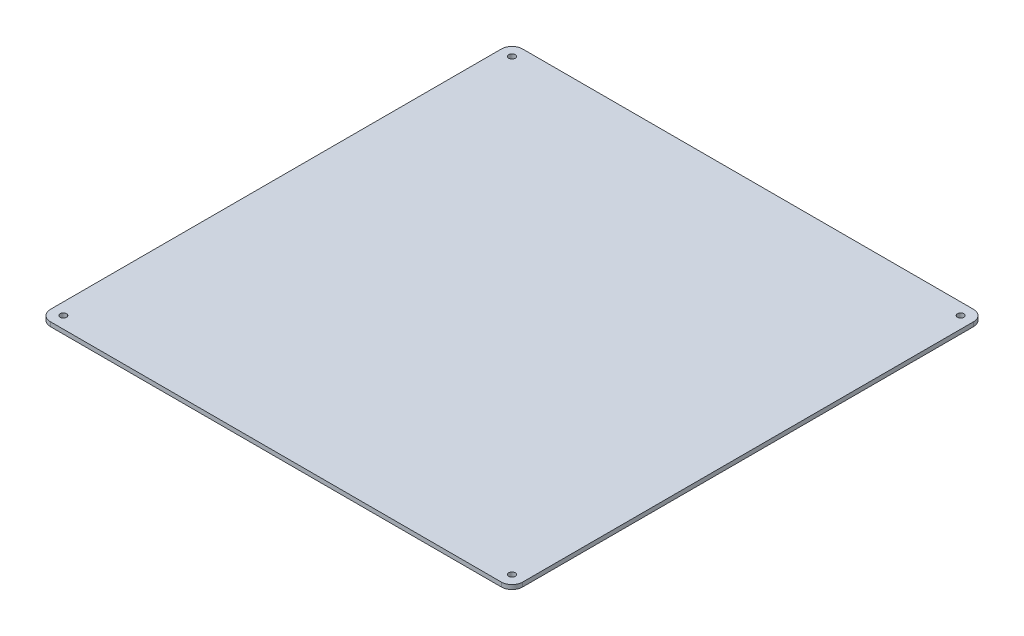
ISO-10303-21;
HEADER;
FILE_DESCRIPTION(('STEP AP214'),'2;1');
FILE_NAME('part.step','',(''),(''),'','','');
FILE_SCHEMA(('AUTOMOTIVE_DESIGN { 1 0 10303 214 1 1 1 1 }'));
ENDSEC;
DATA;
#1=APPLICATION_CONTEXT('core data for automotive mechanical design processes');
#2=APPLICATION_PROTOCOL_DEFINITION('international standard','automotive_design',2000,#1);
#3=PRODUCT_CONTEXT('',#1,'mechanical');
#4=PRODUCT('Part','Part','',(#3));
#5=PRODUCT_RELATED_PRODUCT_CATEGORY('part','',(#4));
#6=PRODUCT_DEFINITION_FORMATION('','',#4);
#7=PRODUCT_DEFINITION_CONTEXT('part definition',#1,'design');
#8=PRODUCT_DEFINITION('design','',#6,#7);
#9=PRODUCT_DEFINITION_SHAPE('','',#8);
#10=(LENGTH_UNIT() NAMED_UNIT(*) SI_UNIT(.MILLI.,.METRE.));
#11=(NAMED_UNIT(*) PLANE_ANGLE_UNIT() SI_UNIT($,.RADIAN.));
#12=(NAMED_UNIT(*) SI_UNIT($,.STERADIAN.) SOLID_ANGLE_UNIT());
#13=UNCERTAINTY_MEASURE_WITH_UNIT(LENGTH_MEASURE(1.E-05),#10,'distance_accuracy_value','');
#14=(GEOMETRIC_REPRESENTATION_CONTEXT(3) GLOBAL_UNCERTAINTY_ASSIGNED_CONTEXT((#13)) GLOBAL_UNIT_ASSIGNED_CONTEXT((#10,
#11,#12)) REPRESENTATION_CONTEXT('',''));
#15=CARTESIAN_POINT('',(0.,0.,0.));
#16=DIRECTION('',(0.,0.,1.));
#17=DIRECTION('',(1.,0.,0.));
#18=AXIS2_PLACEMENT_3D('',#15,#16,#17);
#19=CARTESIAN_POINT('',(0.,-2.,0.));
#20=DIRECTION('',(-1.,0.,0.));
#21=DIRECTION('',(0.,0.,1.));
#22=AXIS2_PLACEMENT_3D('',#19,#20,#21);
#23=PLANE('',#22);
#24=DIRECTION('',(0.,0.,1.));
#25=VECTOR('',#24,1.);
#26=CARTESIAN_POINT('',(0.,0.,0.));
#27=LINE('',#26,#25);
#28=CARTESIAN_POINT('',(0.,0.,-215.));
#29=VERTEX_POINT('',#28);
#30=CARTESIAN_POINT('',(0.,0.,-5.));
#31=VERTEX_POINT('',#30);
#32=EDGE_CURVE('E143',#29,#31,#27,.T.);
#33=ORIENTED_EDGE('',*,*,#32,.F.);
#34=DIRECTION('',(0.,1.,0.));
#35=VECTOR('',#34,1.);
#36=CARTESIAN_POINT('',(0.,-2.,-215.));
#37=LINE('',#36,#35);
#38=CARTESIAN_POINT('',(0.,-2.,-215.));
#39=VERTEX_POINT('',#38);
#40=EDGE_CURVE('E123',#29,#39,#37,.F.);
#41=ORIENTED_EDGE('',*,*,#40,.T.);
#42=DIRECTION('',(0.,0.,1.));
#43=VECTOR('',#42,1.);
#44=CARTESIAN_POINT('',(0.,-2.,0.));
#45=LINE('',#44,#43);
#46=CARTESIAN_POINT('',(0.,-2.,-5.));
#47=VERTEX_POINT('',#46);
#48=EDGE_CURVE('E104',#39,#47,#45,.T.);
#49=ORIENTED_EDGE('',*,*,#48,.T.);
#50=DIRECTION('',(0.,1.,0.));
#51=VECTOR('',#50,1.);
#52=CARTESIAN_POINT('',(0.,-2.,-5.));
#53=LINE('',#52,#51);
#54=EDGE_CURVE('E120',#47,#31,#53,.T.);
#55=ORIENTED_EDGE('',*,*,#54,.T.);
#56=EDGE_LOOP('',(#33,#41,#49,#55));
#57=FACE_BOUND('',#56,.T.);
#58=ADVANCED_FACE('F17',(#57),#23,.T.);
#59=CARTESIAN_POINT('',(0.,-2.,-220.));
#60=DIRECTION('',(0.,0.,-1.));
#61=DIRECTION('',(-1.,0.,0.));
#62=AXIS2_PLACEMENT_3D('',#59,#60,#61);
#63=PLANE('',#62);
#64=DIRECTION('',(-1.,0.,0.));
#65=VECTOR('',#64,1.);
#66=CARTESIAN_POINT('',(0.,-2.,-220.));
#67=LINE('',#66,#65);
#68=CARTESIAN_POINT('',(215.,-2.,-220.));
#69=VERTEX_POINT('',#68);
#70=CARTESIAN_POINT('',(5.,-2.,-220.));
#71=VERTEX_POINT('',#70);
#72=EDGE_CURVE('E109',#69,#71,#67,.T.);
#73=ORIENTED_EDGE('',*,*,#72,.T.);
#74=DIRECTION('',(0.,1.,0.));
#75=VECTOR('',#74,1.);
#76=CARTESIAN_POINT('',(5.,-2.,-220.));
#77=LINE('',#76,#75);
#78=CARTESIAN_POINT('',(5.,0.,-220.));
#79=VERTEX_POINT('',#78);
#80=EDGE_CURVE('E103',#71,#79,#77,.T.);
#81=ORIENTED_EDGE('',*,*,#80,.T.);
#82=DIRECTION('',(-1.,0.,0.));
#83=VECTOR('',#82,1.);
#84=CARTESIAN_POINT('',(0.,0.,-220.));
#85=LINE('',#84,#83);
#86=CARTESIAN_POINT('',(215.,0.,-220.));
#87=VERTEX_POINT('',#86);
#88=EDGE_CURVE('E86',#87,#79,#85,.T.);
#89=ORIENTED_EDGE('',*,*,#88,.F.);
#90=DIRECTION('',(0.,1.,0.));
#91=VECTOR('',#90,1.);
#92=CARTESIAN_POINT('',(215.,-2.,-220.));
#93=LINE('',#92,#91);
#94=EDGE_CURVE('E100',#87,#69,#93,.F.);
#95=ORIENTED_EDGE('',*,*,#94,.T.);
#96=EDGE_LOOP('',(#73,#81,#89,#95));
#97=FACE_BOUND('',#96,.T.);
#98=ADVANCED_FACE('F99',(#97),#63,.T.);
#99=CARTESIAN_POINT('',(220.,-2.,0.));
#100=DIRECTION('',(1.,0.,0.));
#101=DIRECTION('',(0.,0.,-1.));
#102=AXIS2_PLACEMENT_3D('',#99,#100,#101);
#103=PLANE('',#102);
#104=DIRECTION('',(0.,0.,-1.));
#105=VECTOR('',#104,1.);
#106=CARTESIAN_POINT('',(220.,-2.,0.));
#107=LINE('',#106,#105);
#108=CARTESIAN_POINT('',(220.,-2.,-5.));
#109=VERTEX_POINT('',#108);
#110=CARTESIAN_POINT('',(220.,-2.,-215.));
#111=VERTEX_POINT('',#110);
#112=EDGE_CURVE('E113',#109,#111,#107,.T.);
#113=ORIENTED_EDGE('',*,*,#112,.T.);
#114=DIRECTION('',(0.,1.,0.));
#115=VECTOR('',#114,1.);
#116=CARTESIAN_POINT('',(220.,-2.,-215.));
#117=LINE('',#116,#115);
#118=CARTESIAN_POINT('',(220.,0.,-215.));
#119=VERTEX_POINT('',#118);
#120=EDGE_CURVE('E133',#111,#119,#117,.T.);
#121=ORIENTED_EDGE('',*,*,#120,.T.);
#122=DIRECTION('',(0.,0.,-1.));
#123=VECTOR('',#122,1.);
#124=CARTESIAN_POINT('',(220.,0.,0.));
#125=LINE('',#124,#123);
#126=CARTESIAN_POINT('',(220.,0.,-5.));
#127=VERTEX_POINT('',#126);
#128=EDGE_CURVE('E88',#127,#119,#125,.T.);
#129=ORIENTED_EDGE('',*,*,#128,.F.);
#130=DIRECTION('',(0.,1.,0.));
#131=VECTOR('',#130,1.);
#132=CARTESIAN_POINT('',(220.,-2.,-5.));
#133=LINE('',#132,#131);
#134=EDGE_CURVE('E131',#127,#109,#133,.F.);
#135=ORIENTED_EDGE('',*,*,#134,.T.);
#136=EDGE_LOOP('',(#113,#121,#129,#135));
#137=FACE_BOUND('',#136,.T.);
#138=ADVANCED_FACE('F136',(#137),#103,.T.);
#139=CARTESIAN_POINT('',(0.,-2.,0.));
#140=DIRECTION('',(0.,0.,1.));
#141=DIRECTION('',(1.,0.,0.));
#142=AXIS2_PLACEMENT_3D('',#139,#140,#141);
#143=PLANE('',#142);
#144=DIRECTION('',(1.,0.,0.));
#145=VECTOR('',#144,1.);
#146=CARTESIAN_POINT('',(0.,-2.,0.));
#147=LINE('',#146,#145);
#148=CARTESIAN_POINT('',(5.,-2.,0.));
#149=VERTEX_POINT('',#148);
#150=CARTESIAN_POINT('',(215.,-2.,0.));
#151=VERTEX_POINT('',#150);
#152=EDGE_CURVE('E138',#149,#151,#147,.T.);
#153=ORIENTED_EDGE('',*,*,#152,.T.);
#154=DIRECTION('',(0.,1.,0.));
#155=VECTOR('',#154,1.);
#156=CARTESIAN_POINT('',(215.,-2.,0.));
#157=LINE('',#156,#155);
#158=CARTESIAN_POINT('',(215.,0.,0.));
#159=VERTEX_POINT('',#158);
#160=EDGE_CURVE('E11',#151,#159,#157,.T.);
#161=ORIENTED_EDGE('',*,*,#160,.T.);
#162=DIRECTION('',(1.,0.,0.));
#163=VECTOR('',#162,1.);
#164=CARTESIAN_POINT('',(0.,0.,0.));
#165=LINE('',#164,#163);
#166=CARTESIAN_POINT('',(5.,0.,0.));
#167=VERTEX_POINT('',#166);
#168=EDGE_CURVE('E146',#167,#159,#165,.T.);
#169=ORIENTED_EDGE('',*,*,#168,.F.);
#170=DIRECTION('',(0.,1.,0.));
#171=VECTOR('',#170,1.);
#172=CARTESIAN_POINT('',(5.,-2.,0.));
#173=LINE('',#172,#171);
#174=EDGE_CURVE('E25',#167,#149,#173,.F.);
#175=ORIENTED_EDGE('',*,*,#174,.T.);
#176=EDGE_LOOP('',(#153,#161,#169,#175));
#177=FACE_BOUND('',#176,.T.);
#178=ADVANCED_FACE('F149',(#177),#143,.T.);
#179=CARTESIAN_POINT('',(0.,-2.,0.));
#180=DIRECTION('',(0.,-1.,0.));
#181=DIRECTION('',(0.,0.,-1.));
#182=AXIS2_PLACEMENT_3D('',#179,#180,#181);
#183=PLANE('',#182);
#184=CARTESIAN_POINT('',(5.50000000000016,-2.,-214.5));
#185=DIRECTION('',(0.,-1.,0.));
#186=DIRECTION('',(0.,0.,-1.));
#187=AXIS2_PLACEMENT_3D('',#184,#185,#186);
#188=CIRCLE('',#187,1.5);
#189=CARTESIAN_POINT('',(5.50000000000016,-2.,-216.));
#190=VERTEX_POINT('',#189);
#191=EDGE_CURVE('E179',#190,#190,#188,.T.);
#192=ORIENTED_EDGE('',*,*,#191,.F.);
#193=EDGE_LOOP('',(#192));
#194=FACE_BOUND('',#193,.T.);
#195=CARTESIAN_POINT('',(5.50000000000016,-2.,-5.5));
#196=DIRECTION('',(0.,-1.,0.));
#197=DIRECTION('',(0.,0.,-1.));
#198=AXIS2_PLACEMENT_3D('',#195,#196,#197);
#199=CIRCLE('',#198,1.49999999999999);
#200=CARTESIAN_POINT('',(5.50000000000016,-2.,-6.99999999999999));
#201=VERTEX_POINT('',#200);
#202=EDGE_CURVE('E173',#201,#201,#199,.T.);
#203=ORIENTED_EDGE('',*,*,#202,.F.);
#204=EDGE_LOOP('',(#203));
#205=FACE_BOUND('',#204,.T.);
#206=CARTESIAN_POINT('',(214.5,-2.,-214.5));
#207=DIRECTION('',(0.,-1.,0.));
#208=DIRECTION('',(0.,0.,-1.));
#209=AXIS2_PLACEMENT_3D('',#206,#207,#208);
#210=CIRCLE('',#209,1.5);
#211=CARTESIAN_POINT('',(214.5,-2.,-216.));
#212=VERTEX_POINT('',#211);
#213=EDGE_CURVE('E167',#212,#212,#210,.T.);
#214=ORIENTED_EDGE('',*,*,#213,.F.);
#215=EDGE_LOOP('',(#214));
#216=FACE_BOUND('',#215,.T.);
#217=CARTESIAN_POINT('',(214.5,-2.,-5.5));
#218=DIRECTION('',(0.,-1.,0.));
#219=DIRECTION('',(0.,0.,-1.));
#220=AXIS2_PLACEMENT_3D('',#217,#218,#219);
#221=CIRCLE('',#220,1.5);
#222=CARTESIAN_POINT('',(214.5,-2.,-7.));
#223=VERTEX_POINT('',#222);
#224=EDGE_CURVE('E147',#223,#223,#221,.T.);
#225=ORIENTED_EDGE('',*,*,#224,.F.);
#226=EDGE_LOOP('',(#225));
#227=FACE_BOUND('',#226,.T.);
#228=ORIENTED_EDGE('',*,*,#48,.F.);
#229=CARTESIAN_POINT('',(5.,-2.,-215.));
#230=DIRECTION('',(0.,-1.,0.));
#231=DIRECTION('',(0.,0.,-1.));
#232=AXIS2_PLACEMENT_3D('',#229,#230,#231);
#233=CIRCLE('',#232,5.);
#234=EDGE_CURVE('E129',#39,#71,#233,.T.);
#235=ORIENTED_EDGE('',*,*,#234,.T.);
#236=ORIENTED_EDGE('',*,*,#72,.F.);
#237=CARTESIAN_POINT('',(215.,-2.,-215.));
#238=DIRECTION('',(0.,-1.,0.));
#239=DIRECTION('',(0.,0.,-1.));
#240=AXIS2_PLACEMENT_3D('',#237,#238,#239);
#241=CIRCLE('',#240,5.);
#242=EDGE_CURVE('E108',#69,#111,#241,.T.);
#243=ORIENTED_EDGE('',*,*,#242,.T.);
#244=ORIENTED_EDGE('',*,*,#112,.F.);
#245=CARTESIAN_POINT('',(215.,-2.,-5.));
#246=DIRECTION('',(0.,-1.,0.));
#247=DIRECTION('',(0.,0.,-1.));
#248=AXIS2_PLACEMENT_3D('',#245,#246,#247);
#249=CIRCLE('',#248,5.);
#250=EDGE_CURVE('E32',#109,#151,#249,.T.);
#251=ORIENTED_EDGE('',*,*,#250,.T.);
#252=ORIENTED_EDGE('',*,*,#152,.F.);
#253=CARTESIAN_POINT('',(5.,-2.,-5.));
#254=DIRECTION('',(0.,-1.,0.));
#255=DIRECTION('',(0.,0.,-1.));
#256=AXIS2_PLACEMENT_3D('',#253,#254,#255);
#257=CIRCLE('',#256,5.);
#258=EDGE_CURVE('E125',#149,#47,#257,.T.);
#259=ORIENTED_EDGE('',*,*,#258,.T.);
#260=EDGE_LOOP('',(#228,#235,#236,#243,#244,#251,#252,#259));
#261=FACE_BOUND('',#260,.T.);
#262=ADVANCED_FACE('F156',(#194,#205,#216,#227,#261),#183,.T.);
#263=CARTESIAN_POINT('',(0.,0.,0.));
#264=DIRECTION('',(0.,-1.,0.));
#265=DIRECTION('',(0.,0.,-1.));
#266=AXIS2_PLACEMENT_3D('',#263,#264,#265);
#267=PLANE('',#266);
#268=CARTESIAN_POINT('',(5.50000000000016,0.,-214.5));
#269=DIRECTION('',(0.,1.,0.));
#270=DIRECTION('',(0.,0.,1.));
#271=AXIS2_PLACEMENT_3D('',#268,#269,#270);
#272=CIRCLE('',#271,1.5);
#273=CARTESIAN_POINT('',(5.50000000000016,0.,-213.));
#274=VERTEX_POINT('',#273);
#275=EDGE_CURVE('E182',#274,#274,#272,.T.);
#276=ORIENTED_EDGE('',*,*,#275,.F.);
#277=EDGE_LOOP('',(#276));
#278=FACE_BOUND('',#277,.T.);
#279=CARTESIAN_POINT('',(5.50000000000016,0.,-5.5));
#280=DIRECTION('',(0.,1.,0.));
#281=DIRECTION('',(0.,0.,1.));
#282=AXIS2_PLACEMENT_3D('',#279,#280,#281);
#283=CIRCLE('',#282,1.49999999999999);
#284=CARTESIAN_POINT('',(5.50000000000016,0.,-4.00000000000001));
#285=VERTEX_POINT('',#284);
#286=EDGE_CURVE('E176',#285,#285,#283,.T.);
#287=ORIENTED_EDGE('',*,*,#286,.F.);
#288=EDGE_LOOP('',(#287));
#289=FACE_BOUND('',#288,.T.);
#290=CARTESIAN_POINT('',(214.5,0.,-214.5));
#291=DIRECTION('',(0.,1.,0.));
#292=DIRECTION('',(0.,0.,1.));
#293=AXIS2_PLACEMENT_3D('',#290,#291,#292);
#294=CIRCLE('',#293,1.5);
#295=CARTESIAN_POINT('',(214.5,0.,-213.));
#296=VERTEX_POINT('',#295);
#297=EDGE_CURVE('E170',#296,#296,#294,.T.);
#298=ORIENTED_EDGE('',*,*,#297,.F.);
#299=EDGE_LOOP('',(#298));
#300=FACE_BOUND('',#299,.T.);
#301=CARTESIAN_POINT('',(214.5,0.,-5.5));
#302=DIRECTION('',(0.,1.,0.));
#303=DIRECTION('',(0.,0.,1.));
#304=AXIS2_PLACEMENT_3D('',#301,#302,#303);
#305=CIRCLE('',#304,1.5);
#306=CARTESIAN_POINT('',(214.5,0.,-4.));
#307=VERTEX_POINT('',#306);
#308=EDGE_CURVE('E164',#307,#307,#305,.T.);
#309=ORIENTED_EDGE('',*,*,#308,.F.);
#310=EDGE_LOOP('',(#309));
#311=FACE_BOUND('',#310,.T.);
#312=ORIENTED_EDGE('',*,*,#88,.T.);
#313=CARTESIAN_POINT('',(5.,0.,-215.));
#314=DIRECTION('',(0.,-1.,0.));
#315=DIRECTION('',(0.,0.,-1.));
#316=AXIS2_PLACEMENT_3D('',#313,#314,#315);
#317=CIRCLE('',#316,5.);
#318=EDGE_CURVE('E93',#79,#29,#317,.F.);
#319=ORIENTED_EDGE('',*,*,#318,.T.);
#320=ORIENTED_EDGE('',*,*,#32,.T.);
#321=CARTESIAN_POINT('',(5.,0.,-5.));
#322=DIRECTION('',(0.,-1.,0.));
#323=DIRECTION('',(0.,0.,-1.));
#324=AXIS2_PLACEMENT_3D('',#321,#322,#323);
#325=CIRCLE('',#324,5.);
#326=EDGE_CURVE('E111',#31,#167,#325,.F.);
#327=ORIENTED_EDGE('',*,*,#326,.T.);
#328=ORIENTED_EDGE('',*,*,#168,.T.);
#329=CARTESIAN_POINT('',(215.,0.,-5.));
#330=DIRECTION('',(0.,-1.,0.));
#331=DIRECTION('',(0.,0.,-1.));
#332=AXIS2_PLACEMENT_3D('',#329,#330,#331);
#333=CIRCLE('',#332,5.);
#334=EDGE_CURVE('E94',#159,#127,#333,.F.);
#335=ORIENTED_EDGE('',*,*,#334,.T.);
#336=ORIENTED_EDGE('',*,*,#128,.T.);
#337=CARTESIAN_POINT('',(215.,0.,-215.));
#338=DIRECTION('',(0.,-1.,0.));
#339=DIRECTION('',(0.,0.,-1.));
#340=AXIS2_PLACEMENT_3D('',#337,#338,#339);
#341=CIRCLE('',#340,5.);
#342=EDGE_CURVE('E83',#119,#87,#341,.F.);
#343=ORIENTED_EDGE('',*,*,#342,.T.);
#344=EDGE_LOOP('',(#312,#319,#320,#327,#328,#335,#336,#343));
#345=FACE_BOUND('',#344,.T.);
#346=ADVANCED_FACE('F85',(#278,#289,#300,#311,#345),#267,.F.);
#347=CARTESIAN_POINT('',(5.,-2.,-215.));
#348=DIRECTION('',(0.,1.,0.));
#349=DIRECTION('',(0.,0.,1.));
#350=AXIS2_PLACEMENT_3D('',#347,#348,#349);
#351=CYLINDRICAL_SURFACE('',#350,5.);
#352=ORIENTED_EDGE('',*,*,#234,.F.);
#353=ORIENTED_EDGE('',*,*,#40,.F.);
#354=ORIENTED_EDGE('',*,*,#318,.F.);
#355=ORIENTED_EDGE('',*,*,#80,.F.);
#356=EDGE_LOOP('',(#352,#353,#354,#355));
#357=FACE_BOUND('',#356,.T.);
#358=ADVANCED_FACE('F190',(#357),#351,.T.);
#359=CARTESIAN_POINT('',(215.,-2.,-215.));
#360=DIRECTION('',(0.,1.,0.));
#361=DIRECTION('',(0.,0.,1.));
#362=AXIS2_PLACEMENT_3D('',#359,#360,#361);
#363=CYLINDRICAL_SURFACE('',#362,5.);
#364=ORIENTED_EDGE('',*,*,#242,.F.);
#365=ORIENTED_EDGE('',*,*,#94,.F.);
#366=ORIENTED_EDGE('',*,*,#342,.F.);
#367=ORIENTED_EDGE('',*,*,#120,.F.);
#368=EDGE_LOOP('',(#364,#365,#366,#367));
#369=FACE_BOUND('',#368,.T.);
#370=ADVANCED_FACE('F107',(#369),#363,.T.);
#371=CARTESIAN_POINT('',(215.,-2.,-5.));
#372=DIRECTION('',(0.,1.,0.));
#373=DIRECTION('',(0.,0.,1.));
#374=AXIS2_PLACEMENT_3D('',#371,#372,#373);
#375=CYLINDRICAL_SURFACE('',#374,5.);
#376=ORIENTED_EDGE('',*,*,#250,.F.);
#377=ORIENTED_EDGE('',*,*,#134,.F.);
#378=ORIENTED_EDGE('',*,*,#334,.F.);
#379=ORIENTED_EDGE('',*,*,#160,.F.);
#380=EDGE_LOOP('',(#376,#377,#378,#379));
#381=FACE_BOUND('',#380,.T.);
#382=ADVANCED_FACE('F212',(#381),#375,.T.);
#383=CARTESIAN_POINT('',(5.,-2.,-5.));
#384=DIRECTION('',(0.,1.,0.));
#385=DIRECTION('',(0.,0.,1.));
#386=AXIS2_PLACEMENT_3D('',#383,#384,#385);
#387=CYLINDRICAL_SURFACE('',#386,5.);
#388=ORIENTED_EDGE('',*,*,#258,.F.);
#389=ORIENTED_EDGE('',*,*,#174,.F.);
#390=ORIENTED_EDGE('',*,*,#326,.F.);
#391=ORIENTED_EDGE('',*,*,#54,.F.);
#392=EDGE_LOOP('',(#388,#389,#390,#391));
#393=FACE_BOUND('',#392,.T.);
#394=ADVANCED_FACE('F19',(#393),#387,.T.);
#395=CARTESIAN_POINT('',(214.5,-10.,-5.5));
#396=DIRECTION('',(0.,1.,0.));
#397=DIRECTION('',(0.,0.,1.));
#398=AXIS2_PLACEMENT_3D('',#395,#396,#397);
#399=CYLINDRICAL_SURFACE('',#398,1.5);
#400=ORIENTED_EDGE('',*,*,#224,.T.);
#401=EDGE_LOOP('',(#400));
#402=FACE_BOUND('',#401,.T.);
#403=ORIENTED_EDGE('',*,*,#308,.T.);
#404=EDGE_LOOP('',(#403));
#405=FACE_BOUND('',#404,.T.);
#406=ADVANCED_FACE('F198',(#402,#405),#399,.F.);
#407=CARTESIAN_POINT('',(214.5,-10.,-214.5));
#408=DIRECTION('',(0.,1.,0.));
#409=DIRECTION('',(0.,0.,1.));
#410=AXIS2_PLACEMENT_3D('',#407,#408,#409);
#411=CYLINDRICAL_SURFACE('',#410,1.5);
#412=ORIENTED_EDGE('',*,*,#213,.T.);
#413=EDGE_LOOP('',(#412));
#414=FACE_BOUND('',#413,.T.);
#415=ORIENTED_EDGE('',*,*,#297,.T.);
#416=EDGE_LOOP('',(#415));
#417=FACE_BOUND('',#416,.T.);
#418=ADVANCED_FACE('F200',(#414,#417),#411,.F.);
#419=CARTESIAN_POINT('',(5.50000000000016,-10.,-5.5));
#420=DIRECTION('',(0.,1.,0.));
#421=DIRECTION('',(0.,0.,1.));
#422=AXIS2_PLACEMENT_3D('',#419,#420,#421);
#423=CYLINDRICAL_SURFACE('',#422,1.49999999999999);
#424=ORIENTED_EDGE('',*,*,#202,.T.);
#425=EDGE_LOOP('',(#424));
#426=FACE_BOUND('',#425,.T.);
#427=ORIENTED_EDGE('',*,*,#286,.T.);
#428=EDGE_LOOP('',(#427));
#429=FACE_BOUND('',#428,.T.);
#430=ADVANCED_FACE('F209',(#426,#429),#423,.F.);
#431=CARTESIAN_POINT('',(5.50000000000016,-10.,-214.5));
#432=DIRECTION('',(0.,1.,0.));
#433=DIRECTION('',(0.,0.,1.));
#434=AXIS2_PLACEMENT_3D('',#431,#432,#433);
#435=CYLINDRICAL_SURFACE('',#434,1.5);
#436=ORIENTED_EDGE('',*,*,#191,.T.);
#437=EDGE_LOOP('',(#436));
#438=FACE_BOUND('',#437,.T.);
#439=ORIENTED_EDGE('',*,*,#275,.T.);
#440=EDGE_LOOP('',(#439));
#441=FACE_BOUND('',#440,.T.);
#442=ADVANCED_FACE('F186',(#438,#441),#435,.F.);
#443=CLOSED_SHELL('',(#58,#98,#138,#178,#262,#346,#358,#370,#382,#394,#406,#418,#430,#442));
#444=MANIFOLD_SOLID_BREP('B1',#443);
#445=ADVANCED_BREP_SHAPE_REPRESENTATION('',(#18,#444),#14);
#446=SHAPE_DEFINITION_REPRESENTATION(#9,#445);
ENDSEC;
END-ISO-10303-21;
